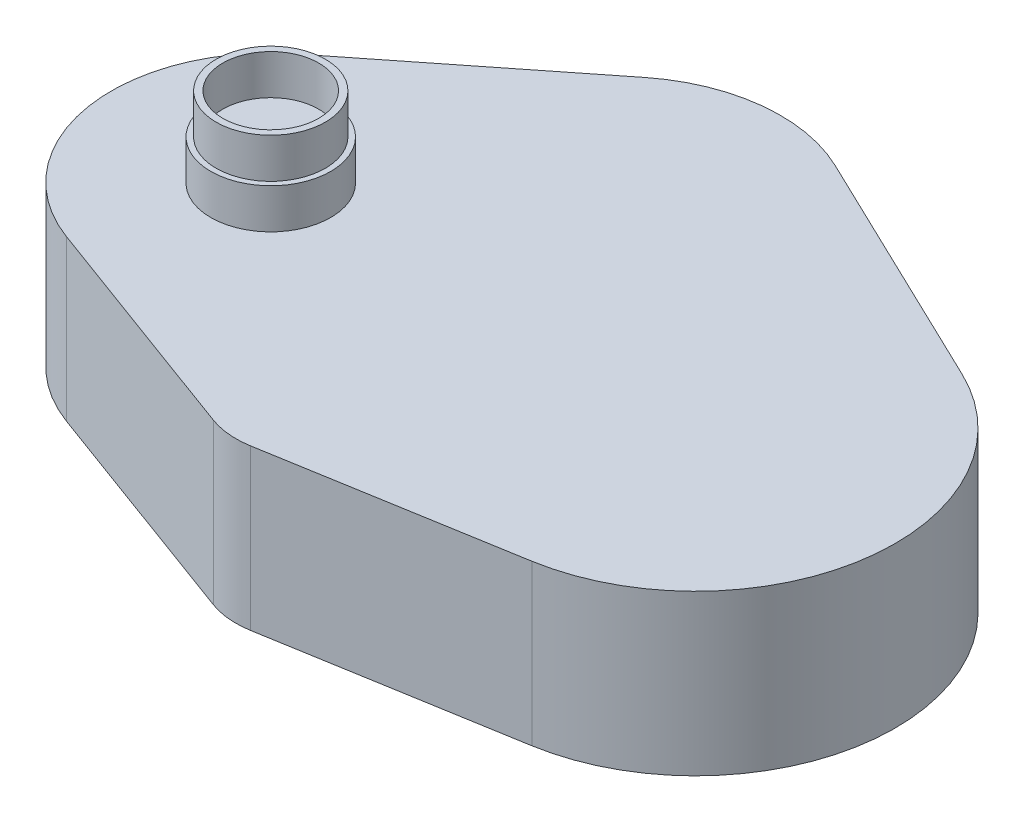
ISO-10303-21;
HEADER;
FILE_DESCRIPTION(('STEP AP214'),'2;1');
FILE_NAME('part.step','',(''),(''),'','','');
FILE_SCHEMA(('AUTOMOTIVE_DESIGN { 1 0 10303 214 1 1 1 1 }'));
ENDSEC;
DATA;
#1=APPLICATION_CONTEXT('core data for automotive mechanical design processes');
#2=APPLICATION_PROTOCOL_DEFINITION('international standard','automotive_design',2000,#1);
#3=PRODUCT_CONTEXT('',#1,'mechanical');
#4=PRODUCT('Part','Part','',(#3));
#5=PRODUCT_RELATED_PRODUCT_CATEGORY('part','',(#4));
#6=PRODUCT_DEFINITION_FORMATION('','',#4);
#7=PRODUCT_DEFINITION_CONTEXT('part definition',#1,'design');
#8=PRODUCT_DEFINITION('design','',#6,#7);
#9=PRODUCT_DEFINITION_SHAPE('','',#8);
#10=(LENGTH_UNIT() NAMED_UNIT(*) SI_UNIT(.MILLI.,.METRE.));
#11=(NAMED_UNIT(*) PLANE_ANGLE_UNIT() SI_UNIT($,.RADIAN.));
#12=(NAMED_UNIT(*) SI_UNIT($,.STERADIAN.) SOLID_ANGLE_UNIT());
#13=UNCERTAINTY_MEASURE_WITH_UNIT(LENGTH_MEASURE(1.E-05),#10,'distance_accuracy_value','');
#14=(GEOMETRIC_REPRESENTATION_CONTEXT(3) GLOBAL_UNCERTAINTY_ASSIGNED_CONTEXT((#13)) GLOBAL_UNIT_ASSIGNED_CONTEXT((#10,
#11,#12)) REPRESENTATION_CONTEXT('',''));
#15=CARTESIAN_POINT('',(0.,0.,0.));
#16=DIRECTION('',(0.,0.,1.));
#17=DIRECTION('',(1.,0.,0.));
#18=AXIS2_PLACEMENT_3D('',#15,#16,#17);
#19=CARTESIAN_POINT('',(-27.5941960823435,20.,19.8915691854565));
#20=DIRECTION('',(0.,-1.,0.));
#21=DIRECTION('',(0.,0.,-1.));
#22=AXIS2_PLACEMENT_3D('',#19,#20,#21);
#23=CYLINDRICAL_SURFACE('',#22,9.99999999999986);
#24=CARTESIAN_POINT('',(-27.5941960823435,0.,19.8915691854565));
#25=DIRECTION('',(0.,1.,0.));
#26=DIRECTION('',(0.,0.,1.));
#27=AXIS2_PLACEMENT_3D('',#24,#25,#26);
#28=CIRCLE('',#27,9.99999999999986);
#29=CARTESIAN_POINT('',(-31.0462938437713,0.,29.2768246985229));
#30=VERTEX_POINT('',#29);
#31=CARTESIAN_POINT('',(-25.922904595049,0.,29.7509193042267));
#32=VERTEX_POINT('',#31);
#33=EDGE_CURVE('E143',#30,#32,#28,.T.);
#34=ORIENTED_EDGE('',*,*,#33,.T.);
#35=DIRECTION('',(0.,-1.,0.));
#36=VECTOR('',#35,1.);
#37=CARTESIAN_POINT('',(-25.922904595049,20.,29.7509193042267));
#38=LINE('',#37,#36);
#39=CARTESIAN_POINT('',(-25.922904595049,20.,29.7509193042267));
#40=VERTEX_POINT('',#39);
#41=EDGE_CURVE('E50',#40,#32,#38,.T.);
#42=ORIENTED_EDGE('',*,*,#41,.F.);
#43=CARTESIAN_POINT('',(-27.5941960823435,20.,19.8915691854565));
#44=DIRECTION('',(0.,1.,0.));
#45=DIRECTION('',(0.,0.,1.));
#46=AXIS2_PLACEMENT_3D('',#43,#44,#45);
#47=CIRCLE('',#46,9.99999999999986);
#48=CARTESIAN_POINT('',(-31.0462938437713,20.,29.2768246985229));
#49=VERTEX_POINT('',#48);
#50=EDGE_CURVE('E166',#49,#40,#47,.T.);
#51=ORIENTED_EDGE('',*,*,#50,.F.);
#52=DIRECTION('',(0.,-1.,0.));
#53=VECTOR('',#52,1.);
#54=CARTESIAN_POINT('',(-31.0462938437713,20.,29.2768246985229));
#55=LINE('',#54,#53);
#56=EDGE_CURVE('E139',#49,#30,#55,.T.);
#57=ORIENTED_EDGE('',*,*,#56,.T.);
#58=EDGE_LOOP('',(#34,#42,#51,#57));
#59=FACE_BOUND('',#58,.T.);
#60=ADVANCED_FACE('F41',(#59),#23,.T.);
#61=CARTESIAN_POINT('',(4.17822871823631,20.,24.648375296926));
#62=DIRECTION('',(-0.167129148729452,0.,-0.985935011877035));
#63=DIRECTION('',(-0.985935011877035,0.,0.167129148729452));
#64=AXIS2_PLACEMENT_3D('',#61,#62,#63);
#65=PLANE('',#64);
#66=DIRECTION('',(0.985935011877035,0.,-0.167129148729452));
#67=VECTOR('',#66,1.);
#68=CARTESIAN_POINT('',(4.17822871823631,0.,24.648375296926));
#69=LINE('',#68,#67);
#70=CARTESIAN_POINT('',(4.17822871823631,0.,24.648375296926));
#71=VERTEX_POINT('',#70);
#72=EDGE_CURVE('E147',#32,#71,#69,.T.);
#73=ORIENTED_EDGE('',*,*,#72,.T.);
#74=DIRECTION('',(0.,-1.,0.));
#75=VECTOR('',#74,1.);
#76=CARTESIAN_POINT('',(4.17822871823631,20.,24.648375296926));
#77=LINE('',#76,#75);
#78=CARTESIAN_POINT('',(4.17822871823631,20.,24.648375296926));
#79=VERTEX_POINT('',#78);
#80=EDGE_CURVE('E181',#79,#71,#77,.T.);
#81=ORIENTED_EDGE('',*,*,#80,.F.);
#82=DIRECTION('',(0.985935011877035,0.,-0.167129148729452));
#83=VECTOR('',#82,1.);
#84=CARTESIAN_POINT('',(4.17822871823631,20.,24.648375296926));
#85=LINE('',#84,#83);
#86=EDGE_CURVE('E102',#40,#79,#85,.T.);
#87=ORIENTED_EDGE('',*,*,#86,.F.);
#88=ORIENTED_EDGE('',*,*,#41,.T.);
#89=EDGE_LOOP('',(#73,#81,#87,#88));
#90=FACE_BOUND('',#89,.T.);
#91=ADVANCED_FACE('F186',(#90),#65,.F.);
#92=CARTESIAN_POINT('',(0.,20.,0.));
#93=DIRECTION('',(0.,-1.,0.));
#94=DIRECTION('',(0.,0.,-1.));
#95=AXIS2_PLACEMENT_3D('',#92,#93,#94);
#96=CYLINDRICAL_SURFACE('',#95,25.0000000000001);
#97=CARTESIAN_POINT('',(0.,0.,0.));
#98=DIRECTION('',(0.,1.,0.));
#99=DIRECTION('',(0.,0.,1.));
#100=AXIS2_PLACEMENT_3D('',#97,#98,#99);
#101=CIRCLE('',#100,25.0000000000001);
#102=CARTESIAN_POINT('',(10.820861572667,0.,-22.5368355104524));
#103=VERTEX_POINT('',#102);
#104=EDGE_CURVE('E151',#71,#103,#101,.T.);
#105=ORIENTED_EDGE('',*,*,#104,.T.);
#106=DIRECTION('',(0.,-1.,0.));
#107=VECTOR('',#106,1.);
#108=CARTESIAN_POINT('',(10.820861572667,20.,-22.5368355104524));
#109=LINE('',#108,#107);
#110=CARTESIAN_POINT('',(10.820861572667,20.,-22.5368355104524));
#111=VERTEX_POINT('',#110);
#112=EDGE_CURVE('E177',#111,#103,#109,.T.);
#113=ORIENTED_EDGE('',*,*,#112,.F.);
#114=CARTESIAN_POINT('',(0.,20.,0.));
#115=DIRECTION('',(0.,1.,0.));
#116=DIRECTION('',(0.,0.,1.));
#117=AXIS2_PLACEMENT_3D('',#114,#115,#116);
#118=CIRCLE('',#117,25.0000000000001);
#119=EDGE_CURVE('E205',#79,#111,#118,.T.);
#120=ORIENTED_EDGE('',*,*,#119,.F.);
#121=ORIENTED_EDGE('',*,*,#80,.T.);
#122=EDGE_LOOP('',(#105,#113,#120,#121));
#123=FACE_BOUND('',#122,.T.);
#124=ADVANCED_FACE('F197',(#123),#96,.T.);
#125=CARTESIAN_POINT('',(-19.7382489332199,20.,-37.2095212304449));
#126=DIRECTION('',(-0.432834462906677,0.,0.901473420418089));
#127=DIRECTION('',(0.901473420418089,0.,0.432834462906677));
#128=AXIS2_PLACEMENT_3D('',#125,#126,#127);
#129=PLANE('',#128);
#130=DIRECTION('',(-0.901473420418089,0.,-0.432834462906676));
#131=VECTOR('',#130,1.);
#132=CARTESIAN_POINT('',(-19.7382489332199,0.,-37.2095212304449));
#133=LINE('',#132,#131);
#134=CARTESIAN_POINT('',(-19.73824893322,0.,-37.2095212304447));
#135=VERTEX_POINT('',#134);
#136=EDGE_CURVE('E154',#103,#135,#133,.T.);
#137=ORIENTED_EDGE('',*,*,#136,.T.);
#138=DIRECTION('',(0.,-1.,0.));
#139=VECTOR('',#138,1.);
#140=CARTESIAN_POINT('',(-19.73824893322,20.,-37.2095212304447));
#141=LINE('',#140,#139);
#142=CARTESIAN_POINT('',(-19.73824893322,20.,-37.2095212304447));
#143=VERTEX_POINT('',#142);
#144=EDGE_CURVE('E173',#143,#135,#141,.T.);
#145=ORIENTED_EDGE('',*,*,#144,.F.);
#146=DIRECTION('',(-0.901473420418089,0.,-0.432834462906676));
#147=VECTOR('',#146,1.);
#148=CARTESIAN_POINT('',(-19.7382489332199,20.,-37.2095212304449));
#149=LINE('',#148,#147);
#150=EDGE_CURVE('E203',#111,#143,#149,.T.);
#151=ORIENTED_EDGE('',*,*,#150,.F.);
#152=ORIENTED_EDGE('',*,*,#112,.T.);
#153=EDGE_LOOP('',(#137,#145,#151,#152));
#154=FACE_BOUND('',#153,.T.);
#155=ADVANCED_FACE('F201',(#154),#129,.F.);
#156=CARTESIAN_POINT('',(-28.5477070651192,20.,-18.8618778823102));
#157=DIRECTION('',(0.,-1.,0.));
#158=DIRECTION('',(0.,0.,-1.));
#159=AXIS2_PLACEMENT_3D('',#156,#157,#158);
#160=CYLINDRICAL_SURFACE('',#159,20.3529498846734);
#161=CARTESIAN_POINT('',(-28.5477070651192,0.,-18.8618778823102));
#162=DIRECTION('',(0.,1.,0.));
#163=DIRECTION('',(0.,0.,1.));
#164=AXIS2_PLACEMENT_3D('',#161,#162,#163);
#165=CIRCLE('',#164,20.3529498846734);
#166=CARTESIAN_POINT('',(-41.1759931180844,0.,-34.8233615342927));
#167=VERTEX_POINT('',#166);
#168=EDGE_CURVE('E157',#135,#167,#165,.T.);
#169=ORIENTED_EDGE('',*,*,#168,.T.);
#170=DIRECTION('',(0.,-1.,0.));
#171=VECTOR('',#170,1.);
#172=CARTESIAN_POINT('',(-41.1759931180844,20.,-34.8233615342927));
#173=LINE('',#172,#171);
#174=CARTESIAN_POINT('',(-41.1759931180844,20.,-34.8233615342927));
#175=VERTEX_POINT('',#174);
#176=EDGE_CURVE('E132',#175,#167,#173,.T.);
#177=ORIENTED_EDGE('',*,*,#176,.F.);
#178=CARTESIAN_POINT('',(-28.5477070651192,20.,-18.8618778823102));
#179=DIRECTION('',(0.,1.,0.));
#180=DIRECTION('',(0.,0.,1.));
#181=AXIS2_PLACEMENT_3D('',#178,#179,#180);
#182=CIRCLE('',#181,20.3529498846734);
#183=EDGE_CURVE('E121',#143,#175,#182,.T.);
#184=ORIENTED_EDGE('',*,*,#183,.F.);
#185=ORIENTED_EDGE('',*,*,#144,.T.);
#186=EDGE_LOOP('',(#169,#177,#184,#185));
#187=FACE_BOUND('',#186,.T.);
#188=ADVANCED_FACE('F266',(#187),#160,.T.);
#189=CARTESIAN_POINT('',(-65.5600503736831,20.,-15.5313673268899));
#190=DIRECTION('',(0.620464656205703,0.,0.784234410364362));
#191=DIRECTION('',(0.784234410364362,0.,-0.620464656205703));
#192=AXIS2_PLACEMENT_3D('',#189,#190,#191);
#193=PLANE('',#192);
#194=DIRECTION('',(-0.784234410364362,0.,0.620464656205703));
#195=VECTOR('',#194,1.);
#196=CARTESIAN_POINT('',(-65.5600503736831,0.,-15.5313673268899));
#197=LINE('',#196,#195);
#198=CARTESIAN_POINT('',(-65.5600503736831,0.,-15.5313673268899));
#199=VERTEX_POINT('',#198);
#200=EDGE_CURVE('E130',#167,#199,#197,.T.);
#201=ORIENTED_EDGE('',*,*,#200,.T.);
#202=DIRECTION('',(0.,-1.,0.));
#203=VECTOR('',#202,1.);
#204=CARTESIAN_POINT('',(-65.5600503736831,20.,-15.5313673268899));
#205=LINE('',#204,#203);
#206=CARTESIAN_POINT('',(-65.5600503736831,20.,-15.5313673268899));
#207=VERTEX_POINT('',#206);
#208=EDGE_CURVE('E127',#207,#199,#205,.T.);
#209=ORIENTED_EDGE('',*,*,#208,.F.);
#210=DIRECTION('',(-0.784234410364362,0.,0.620464656205703));
#211=VECTOR('',#210,1.);
#212=CARTESIAN_POINT('',(-65.5600503736831,20.,-15.5313673268899));
#213=LINE('',#212,#211);
#214=EDGE_CURVE('E115',#175,#207,#213,.T.);
#215=ORIENTED_EDGE('',*,*,#214,.F.);
#216=ORIENTED_EDGE('',*,*,#176,.T.);
#217=EDGE_LOOP('',(#201,#209,#215,#216));
#218=FACE_BOUND('',#217,.T.);
#219=ADVANCED_FACE('F128',(#218),#193,.F.);
#220=CARTESIAN_POINT('',(-53.2720605054424,20.,-3.44522441397165E-13));
#221=DIRECTION('',(0.,-1.,0.));
#222=DIRECTION('',(0.,0.,-1.));
#223=AXIS2_PLACEMENT_3D('',#220,#221,#222);
#224=CYLINDRICAL_SURFACE('',#223,19.8044961068127);
#225=CARTESIAN_POINT('',(-53.2720605054424,0.,-3.44522441397165E-13));
#226=DIRECTION('',(0.,1.,0.));
#227=DIRECTION('',(0.,0.,1.));
#228=AXIS2_PLACEMENT_3D('',#225,#226,#227);
#229=CIRCLE('',#228,19.8044961068127);
#230=CARTESIAN_POINT('',(-60.1087661730956,0.,18.5870256269965));
#231=VERTEX_POINT('',#230);
#232=EDGE_CURVE('E87',#199,#231,#229,.T.);
#233=ORIENTED_EDGE('',*,*,#232,.T.);
#234=DIRECTION('',(0.,-1.,0.));
#235=VECTOR('',#234,1.);
#236=CARTESIAN_POINT('',(-60.1087661730956,20.,18.5870256269965));
#237=LINE('',#236,#235);
#238=CARTESIAN_POINT('',(-60.1087661730956,20.,18.5870256269965));
#239=VERTEX_POINT('',#238);
#240=EDGE_CURVE('E133',#239,#231,#237,.T.);
#241=ORIENTED_EDGE('',*,*,#240,.F.);
#242=CARTESIAN_POINT('',(-53.2720605054424,20.,-3.44522441397165E-13));
#243=DIRECTION('',(0.,1.,0.));
#244=DIRECTION('',(0.,0.,1.));
#245=AXIS2_PLACEMENT_3D('',#242,#243,#244);
#246=CIRCLE('',#245,19.8044961068127);
#247=EDGE_CURVE('E119',#207,#239,#246,.T.);
#248=ORIENTED_EDGE('',*,*,#247,.F.);
#249=ORIENTED_EDGE('',*,*,#208,.T.);
#250=EDGE_LOOP('',(#233,#241,#248,#249));
#251=FACE_BOUND('',#250,.T.);
#252=ADVANCED_FACE('F135',(#251),#224,.T.);
#253=CARTESIAN_POINT('',(-31.0462938437713,20.,29.2768246985229));
#254=DIRECTION('',(0.345209776142776,0.,-0.938525551306652));
#255=DIRECTION('',(-0.938525551306652,0.,-0.345209776142776));
#256=AXIS2_PLACEMENT_3D('',#253,#254,#255);
#257=PLANE('',#256);
#258=DIRECTION('',(0.938525551306652,0.,0.345209776142775));
#259=VECTOR('',#258,1.);
#260=CARTESIAN_POINT('',(-31.0462938437713,0.,29.2768246985229));
#261=LINE('',#260,#259);
#262=EDGE_CURVE('E93',#231,#30,#261,.T.);
#263=ORIENTED_EDGE('',*,*,#262,.T.);
#264=ORIENTED_EDGE('',*,*,#56,.F.);
#265=DIRECTION('',(0.938525551306652,0.,0.345209776142775));
#266=VECTOR('',#265,1.);
#267=CARTESIAN_POINT('',(-31.0462938437713,20.,29.2768246985229));
#268=LINE('',#267,#266);
#269=EDGE_CURVE('E58',#239,#49,#268,.T.);
#270=ORIENTED_EDGE('',*,*,#269,.F.);
#271=ORIENTED_EDGE('',*,*,#240,.T.);
#272=EDGE_LOOP('',(#263,#264,#270,#271));
#273=FACE_BOUND('',#272,.T.);
#274=ADVANCED_FACE('F274',(#273),#257,.F.);
#275=CARTESIAN_POINT('',(-27.5941960823435,20.,19.8915691854565));
#276=DIRECTION('',(0.,1.,0.));
#277=DIRECTION('',(0.,0.,1.));
#278=AXIS2_PLACEMENT_3D('',#275,#276,#277);
#279=PLANE('',#278);
#280=CARTESIAN_POINT('',(-53.1295736547696,20.,0.));
#281=DIRECTION('',(0.,1.,0.));
#282=DIRECTION('',(0.,0.,1.));
#283=AXIS2_PLACEMENT_3D('',#280,#281,#282);
#284=CIRCLE('',#283,7.5);
#285=CARTESIAN_POINT('',(-53.1295736547696,20.,7.5));
#286=VERTEX_POINT('',#285);
#287=EDGE_CURVE('E215',#286,#286,#284,.T.);
#288=ORIENTED_EDGE('',*,*,#287,.F.);
#289=EDGE_LOOP('',(#288));
#290=FACE_BOUND('',#289,.T.);
#291=ORIENTED_EDGE('',*,*,#50,.T.);
#292=ORIENTED_EDGE('',*,*,#86,.T.);
#293=ORIENTED_EDGE('',*,*,#119,.T.);
#294=ORIENTED_EDGE('',*,*,#150,.T.);
#295=ORIENTED_EDGE('',*,*,#183,.T.);
#296=ORIENTED_EDGE('',*,*,#214,.T.);
#297=ORIENTED_EDGE('',*,*,#247,.T.);
#298=ORIENTED_EDGE('',*,*,#269,.T.);
#299=EDGE_LOOP('',(#291,#292,#293,#294,#295,#296,#297,#298));
#300=FACE_BOUND('',#299,.T.);
#301=ADVANCED_FACE('F117',(#290,#300),#279,.T.);
#302=CARTESIAN_POINT('',(-27.5941960823435,0.,19.8915691854565));
#303=DIRECTION('',(0.,1.,0.));
#304=DIRECTION('',(0.,0.,1.));
#305=AXIS2_PLACEMENT_3D('',#302,#303,#304);
#306=PLANE('',#305);
#307=ORIENTED_EDGE('',*,*,#33,.F.);
#308=ORIENTED_EDGE('',*,*,#262,.F.);
#309=ORIENTED_EDGE('',*,*,#232,.F.);
#310=ORIENTED_EDGE('',*,*,#200,.F.);
#311=ORIENTED_EDGE('',*,*,#168,.F.);
#312=ORIENTED_EDGE('',*,*,#136,.F.);
#313=ORIENTED_EDGE('',*,*,#104,.F.);
#314=ORIENTED_EDGE('',*,*,#72,.F.);
#315=EDGE_LOOP('',(#307,#308,#309,#310,#311,#312,#313,#314));
#316=FACE_BOUND('',#315,.T.);
#317=ADVANCED_FACE('F191',(#316),#306,.F.);
#318=CARTESIAN_POINT('',(-53.1295736547696,25.,0.));
#319=DIRECTION('',(0.,-1.,0.));
#320=DIRECTION('',(0.,0.,-1.));
#321=AXIS2_PLACEMENT_3D('',#318,#319,#320);
#322=CYLINDRICAL_SURFACE('',#321,7.5);
#323=CARTESIAN_POINT('',(-53.1295736547696,25.,0.));
#324=DIRECTION('',(0.,1.,0.));
#325=DIRECTION('',(0.,0.,1.));
#326=AXIS2_PLACEMENT_3D('',#323,#324,#325);
#327=CIRCLE('',#326,7.5);
#328=CARTESIAN_POINT('',(-53.1295736547696,25.,7.5));
#329=VERTEX_POINT('',#328);
#330=EDGE_CURVE('E148',#329,#329,#327,.T.);
#331=ORIENTED_EDGE('',*,*,#330,.F.);
#332=EDGE_LOOP('',(#331));
#333=FACE_BOUND('',#332,.T.);
#334=ORIENTED_EDGE('',*,*,#287,.T.);
#335=EDGE_LOOP('',(#334));
#336=FACE_BOUND('',#335,.T.);
#337=ADVANCED_FACE('F250',(#333,#336),#322,.T.);
#338=CARTESIAN_POINT('',(-53.1295736547696,25.,0.));
#339=DIRECTION('',(0.,1.,0.));
#340=DIRECTION('',(0.,0.,1.));
#341=AXIS2_PLACEMENT_3D('',#338,#339,#340);
#342=PLANE('',#341);
#343=CARTESIAN_POINT('',(-53.1295736547696,25.,0.));
#344=DIRECTION('',(0.,1.,0.));
#345=DIRECTION('',(0.,0.,1.));
#346=AXIS2_PLACEMENT_3D('',#343,#344,#345);
#347=CIRCLE('',#346,6.82913276286914);
#348=CARTESIAN_POINT('',(-53.1295736547696,25.,6.82913276286914));
#349=VERTEX_POINT('',#348);
#350=EDGE_CURVE('E223',#349,#349,#347,.T.);
#351=ORIENTED_EDGE('',*,*,#350,.F.);
#352=EDGE_LOOP('',(#351));
#353=FACE_BOUND('',#352,.T.);
#354=ORIENTED_EDGE('',*,*,#330,.T.);
#355=EDGE_LOOP('',(#354));
#356=FACE_BOUND('',#355,.T.);
#357=ADVANCED_FACE('F241',(#353,#356),#342,.T.);
#358=CARTESIAN_POINT('',(-53.1295736547696,30.,0.));
#359=DIRECTION('',(0.,1.,0.));
#360=DIRECTION('',(0.,0.,1.));
#361=AXIS2_PLACEMENT_3D('',#358,#359,#360);
#362=PLANE('',#361);
#363=CARTESIAN_POINT('',(-53.1295736547696,30.,0.));
#364=DIRECTION('',(0.,1.,0.));
#365=DIRECTION('',(0.,0.,1.));
#366=AXIS2_PLACEMENT_3D('',#363,#364,#365);
#367=CIRCLE('',#366,6.82913276286914);
#368=CARTESIAN_POINT('',(-53.1295736547696,30.,6.82913276286914));
#369=VERTEX_POINT('',#368);
#370=EDGE_CURVE('E219',#369,#369,#367,.T.);
#371=ORIENTED_EDGE('',*,*,#370,.T.);
#372=EDGE_LOOP('',(#371));
#373=FACE_BOUND('',#372,.T.);
#374=CARTESIAN_POINT('',(-53.1295736547696,30.,0.));
#375=DIRECTION('',(0.,1.,0.));
#376=DIRECTION('',(0.,0.,1.));
#377=AXIS2_PLACEMENT_3D('',#374,#375,#376);
#378=CIRCLE('',#377,6.);
#379=CARTESIAN_POINT('',(-53.1295736547696,30.,6.));
#380=VERTEX_POINT('',#379);
#381=EDGE_CURVE('E227',#380,#380,#378,.T.);
#382=ORIENTED_EDGE('',*,*,#381,.F.);
#383=EDGE_LOOP('',(#382));
#384=FACE_BOUND('',#383,.T.);
#385=ADVANCED_FACE('F238',(#373,#384),#362,.T.);
#386=CARTESIAN_POINT('',(-53.1295736547696,30.,0.));
#387=DIRECTION('',(0.,-1.,0.));
#388=DIRECTION('',(0.,0.,-1.));
#389=AXIS2_PLACEMENT_3D('',#386,#387,#388);
#390=CYLINDRICAL_SURFACE('',#389,6.82913276286914);
#391=ORIENTED_EDGE('',*,*,#370,.F.);
#392=EDGE_LOOP('',(#391));
#393=FACE_BOUND('',#392,.T.);
#394=ORIENTED_EDGE('',*,*,#350,.T.);
#395=EDGE_LOOP('',(#394));
#396=FACE_BOUND('',#395,.T.);
#397=ADVANCED_FACE('F240',(#393,#396),#390,.T.);
#398=CARTESIAN_POINT('',(-53.1295736547696,30.,0.));
#399=DIRECTION('',(0.,-1.,0.));
#400=DIRECTION('',(0.,0.,-1.));
#401=AXIS2_PLACEMENT_3D('',#398,#399,#400);
#402=CYLINDRICAL_SURFACE('',#401,6.);
#403=ORIENTED_EDGE('',*,*,#381,.T.);
#404=EDGE_LOOP('',(#403));
#405=FACE_BOUND('',#404,.T.);
#406=CARTESIAN_POINT('',(-53.1295736547696,25.,0.));
#407=DIRECTION('',(0.,1.,0.));
#408=DIRECTION('',(0.,0.,1.));
#409=AXIS2_PLACEMENT_3D('',#406,#407,#408);
#410=CIRCLE('',#409,6.);
#411=CARTESIAN_POINT('',(-53.1295736547696,25.,6.));
#412=VERTEX_POINT('',#411);
#413=EDGE_CURVE('E11',#412,#412,#410,.F.);
#414=ORIENTED_EDGE('',*,*,#413,.T.);
#415=EDGE_LOOP('',(#414));
#416=FACE_BOUND('',#415,.T.);
#417=ADVANCED_FACE('F235',(#405,#416),#402,.F.);
#418=ORIENTED_EDGE('',*,*,#413,.F.);
#419=EDGE_LOOP('',(#418));
#420=FACE_BOUND('',#419,.T.);
#421=ADVANCED_FACE('F253',(#420),#342,.T.);
#422=CLOSED_SHELL('',(#60,#91,#124,#155,#188,#219,#252,#274,#301,#317,#337,#357,#385,#397,#417,#421));
#423=MANIFOLD_SOLID_BREP('B2',#422);
#424=ADVANCED_BREP_SHAPE_REPRESENTATION('',(#18,#423),#14);
#425=SHAPE_DEFINITION_REPRESENTATION(#9,#424);
ENDSEC;
END-ISO-10303-21;
